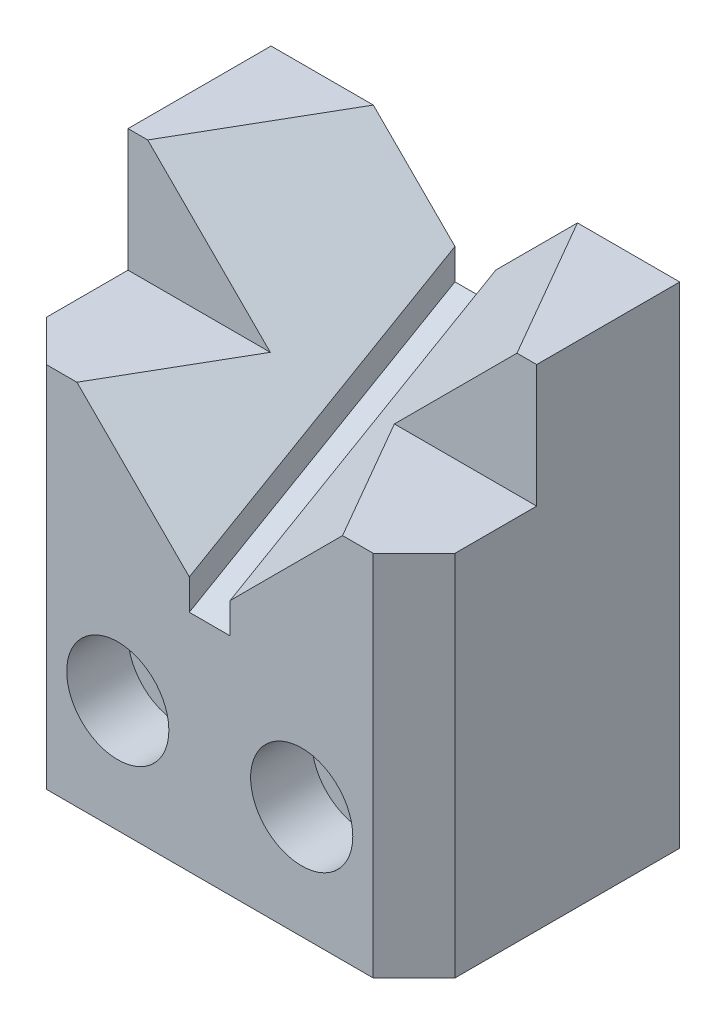
ISO-10303-21;
HEADER;
FILE_DESCRIPTION(('STEP AP214'),'2;1');
FILE_NAME('part.step','',(''),(''),'','','');
FILE_SCHEMA(('AUTOMOTIVE_DESIGN { 1 0 10303 214 1 1 1 1 }'));
ENDSEC;
DATA;
#1=APPLICATION_CONTEXT('core data for automotive mechanical design processes');
#2=APPLICATION_PROTOCOL_DEFINITION('international standard','automotive_design',2000,#1);
#3=PRODUCT_CONTEXT('',#1,'mechanical');
#4=PRODUCT('Part','Part','',(#3));
#5=PRODUCT_RELATED_PRODUCT_CATEGORY('part','',(#4));
#6=PRODUCT_DEFINITION_FORMATION('','',#4);
#7=PRODUCT_DEFINITION_CONTEXT('part definition',#1,'design');
#8=PRODUCT_DEFINITION('design','',#6,#7);
#9=PRODUCT_DEFINITION_SHAPE('','',#8);
#10=(LENGTH_UNIT() NAMED_UNIT(*) SI_UNIT(.MILLI.,.METRE.));
#11=(NAMED_UNIT(*) PLANE_ANGLE_UNIT() SI_UNIT($,.RADIAN.));
#12=(NAMED_UNIT(*) SI_UNIT($,.STERADIAN.) SOLID_ANGLE_UNIT());
#13=UNCERTAINTY_MEASURE_WITH_UNIT(LENGTH_MEASURE(1.E-05),#10,'distance_accuracy_value','');
#14=(GEOMETRIC_REPRESENTATION_CONTEXT(3) GLOBAL_UNCERTAINTY_ASSIGNED_CONTEXT((#13)) GLOBAL_UNIT_ASSIGNED_CONTEXT((#10,
#11,#12)) REPRESENTATION_CONTEXT('',''));
#15=CARTESIAN_POINT('',(0.,0.,0.));
#16=DIRECTION('',(0.,0.,1.));
#17=DIRECTION('',(1.,0.,0.));
#18=AXIS2_PLACEMENT_3D('',#15,#16,#17);
#19=CARTESIAN_POINT('',(31.75,0.,20.6375));
#20=DIRECTION('',(0.,0.,-1.));
#21=DIRECTION('',(-1.,0.,0.));
#22=AXIS2_PLACEMENT_3D('',#19,#20,#21);
#23=PLANE('',#22);
#24=CARTESIAN_POINT('',(14.2875,17.4625,20.6375));
#25=DIRECTION('',(0.,0.,1.));
#26=DIRECTION('',(1.,0.,0.));
#27=AXIS2_PLACEMENT_3D('',#24,#25,#26);
#28=CIRCLE('',#27,7.9375);
#29=CARTESIAN_POINT('',(22.225,17.4625,20.6375));
#30=VERTEX_POINT('',#29);
#31=EDGE_CURVE('E210',#30,#30,#28,.T.);
#32=ORIENTED_EDGE('',*,*,#31,.F.);
#33=EDGE_LOOP('',(#32));
#34=FACE_BOUND('',#33,.T.);
#35=CARTESIAN_POINT('',(-14.2875,17.4625,20.6375));
#36=DIRECTION('',(0.,0.,1.));
#37=DIRECTION('',(1.,0.,0.));
#38=AXIS2_PLACEMENT_3D('',#35,#36,#37);
#39=CIRCLE('',#38,7.9375);
#40=CARTESIAN_POINT('',(-6.35,17.4625,20.6375));
#41=VERTEX_POINT('',#40);
#42=EDGE_CURVE('E211',#41,#41,#39,.F.);
#43=ORIENTED_EDGE('',*,*,#42,.T.);
#44=EDGE_LOOP('',(#43));
#45=FACE_BOUND('',#44,.T.);
#46=DIRECTION('',(-1.,0.,0.));
#47=VECTOR('',#46,1.);
#48=CARTESIAN_POINT('',(31.75,57.15,20.6375));
#49=LINE('',#48,#47);
#50=CARTESIAN_POINT('',(-20.6375000000001,57.15,20.6375));
#51=VERTEX_POINT('',#50);
#52=CARTESIAN_POINT('',(-25.4,57.15,20.6375));
#53=VERTEX_POINT('',#52);
#54=EDGE_CURVE('E231',#51,#53,#49,.T.);
#55=ORIENTED_EDGE('',*,*,#54,.T.);
#56=DIRECTION('',(0.,-1.,0.));
#57=VECTOR('',#56,1.);
#58=CARTESIAN_POINT('',(-25.4,0.,20.6375));
#59=LINE('',#58,#57);
#60=CARTESIAN_POINT('',(-25.4,0.,20.6375));
#61=VERTEX_POINT('',#60);
#62=EDGE_CURVE('E281',#53,#61,#59,.T.);
#63=ORIENTED_EDGE('',*,*,#62,.T.);
#64=DIRECTION('',(-1.,0.,0.));
#65=VECTOR('',#64,1.);
#66=CARTESIAN_POINT('',(31.75,0.,20.6375));
#67=LINE('',#66,#65);
#68=CARTESIAN_POINT('',(25.4,0.,20.6375));
#69=VERTEX_POINT('',#68);
#70=EDGE_CURVE('E259',#69,#61,#67,.T.);
#71=ORIENTED_EDGE('',*,*,#70,.F.);
#72=DIRECTION('',(0.,1.,0.));
#73=VECTOR('',#72,1.);
#74=CARTESIAN_POINT('',(25.4,0.,20.6375));
#75=LINE('',#74,#73);
#76=CARTESIAN_POINT('',(25.4,57.15,20.6375));
#77=VERTEX_POINT('',#76);
#78=EDGE_CURVE('E279',#69,#77,#75,.T.);
#79=ORIENTED_EDGE('',*,*,#78,.T.);
#80=CARTESIAN_POINT('',(20.6375000000001,57.15,20.6375));
#81=VERTEX_POINT('',#80);
#82=EDGE_CURVE('E171',#77,#81,#49,.T.);
#83=ORIENTED_EDGE('',*,*,#82,.T.);
#84=DIRECTION('',(-0.707106781186549,-0.707106781186546,0.));
#85=VECTOR('',#84,1.);
#86=CARTESIAN_POINT('',(39.6875000000001,76.2,20.6375));
#87=LINE('',#86,#85);
#88=CARTESIAN_POINT('',(3.175,39.6875,20.6375));
#89=VERTEX_POINT('',#88);
#90=EDGE_CURVE('E152',#81,#89,#87,.T.);
#91=ORIENTED_EDGE('',*,*,#90,.T.);
#92=DIRECTION('',(0.,-1.,0.));
#93=VECTOR('',#92,1.);
#94=CARTESIAN_POINT('',(3.175,39.6875,20.6375));
#95=LINE('',#94,#93);
#96=CARTESIAN_POINT('',(3.175,34.925,20.6375));
#97=VERTEX_POINT('',#96);
#98=EDGE_CURVE('E162',#89,#97,#95,.T.);
#99=ORIENTED_EDGE('',*,*,#98,.T.);
#100=DIRECTION('',(1.,0.,0.));
#101=VECTOR('',#100,1.);
#102=CARTESIAN_POINT('',(-3.175,34.925,20.6375));
#103=LINE('',#102,#101);
#104=CARTESIAN_POINT('',(-3.175,34.925,20.6375));
#105=VERTEX_POINT('',#104);
#106=EDGE_CURVE('E168',#105,#97,#103,.T.);
#107=ORIENTED_EDGE('',*,*,#106,.F.);
#108=DIRECTION('',(0.,-1.,0.));
#109=VECTOR('',#108,1.);
#110=CARTESIAN_POINT('',(-3.175,39.6875,20.6375));
#111=LINE('',#110,#109);
#112=CARTESIAN_POINT('',(-3.175,39.6875,20.6375));
#113=VERTEX_POINT('',#112);
#114=EDGE_CURVE('E175',#113,#105,#111,.T.);
#115=ORIENTED_EDGE('',*,*,#114,.F.);
#116=DIRECTION('',(0.707106781186549,-0.707106781186546,0.));
#117=VECTOR('',#116,1.);
#118=CARTESIAN_POINT('',(-39.6875000000001,76.2,20.6375));
#119=LINE('',#118,#117);
#120=EDGE_CURVE('E178',#51,#113,#119,.T.);
#121=ORIENTED_EDGE('',*,*,#120,.F.);
#122=EDGE_LOOP('',(#55,#63,#71,#79,#83,#91,#99,#107,#115,#121));
#123=FACE_BOUND('',#122,.T.);
#124=ADVANCED_FACE('F33',(#34,#45,#123),#23,.F.);
#125=CARTESIAN_POINT('',(31.75,76.2,-20.6375));
#126=DIRECTION('',(0.,0.,1.));
#127=DIRECTION('',(0.,-1.,0.));
#128=AXIS2_PLACEMENT_3D('',#125,#126,#127);
#129=PLANE('',#128);
#130=CARTESIAN_POINT('',(-14.2875,17.4625,-20.6375));
#131=DIRECTION('',(0.,0.,1.));
#132=DIRECTION('',(1.,0.,0.));
#133=AXIS2_PLACEMENT_3D('',#130,#131,#132);
#134=CIRCLE('',#133,4.7625);
#135=CARTESIAN_POINT('',(-9.525,17.4625,-20.6375));
#136=VERTEX_POINT('',#135);
#137=EDGE_CURVE('E203',#136,#136,#134,.F.);
#138=ORIENTED_EDGE('',*,*,#137,.F.);
#139=EDGE_LOOP('',(#138));
#140=FACE_BOUND('',#139,.T.);
#141=CARTESIAN_POINT('',(14.2875,17.4625,-20.6375));
#142=DIRECTION('',(0.,0.,1.));
#143=DIRECTION('',(1.,0.,0.));
#144=AXIS2_PLACEMENT_3D('',#141,#142,#143);
#145=CIRCLE('',#144,4.7625);
#146=CARTESIAN_POINT('',(19.05,17.4625,-20.6375));
#147=VERTEX_POINT('',#146);
#148=EDGE_CURVE('E199',#147,#147,#145,.T.);
#149=ORIENTED_EDGE('',*,*,#148,.T.);
#150=EDGE_LOOP('',(#149));
#151=FACE_BOUND('',#150,.T.);
#152=DIRECTION('',(-0.707106781186549,-0.707106781186546,0.));
#153=VECTOR('',#152,1.);
#154=CARTESIAN_POINT('',(23.8036838195992,84.1463161804008,-20.6375));
#155=LINE('',#154,#153);
#156=CARTESIAN_POINT('',(15.8573676391984,76.2,-20.6375));
#157=VERTEX_POINT('',#156);
#158=CARTESIAN_POINT('',(3.175,63.5176323608017,-20.6375));
#159=VERTEX_POINT('',#158);
#160=EDGE_CURVE('E155',#157,#159,#155,.T.);
#161=ORIENTED_EDGE('',*,*,#160,.F.);
#162=DIRECTION('',(-1.,0.,0.));
#163=VECTOR('',#162,1.);
#164=CARTESIAN_POINT('',(31.75,76.2,-20.6375));
#165=LINE('',#164,#163);
#166=CARTESIAN_POINT('',(31.75,76.2,-20.6375));
#167=VERTEX_POINT('',#166);
#168=EDGE_CURVE('E253',#167,#157,#165,.T.);
#169=ORIENTED_EDGE('',*,*,#168,.F.);
#170=DIRECTION('',(0.,1.,0.));
#171=VECTOR('',#170,1.);
#172=CARTESIAN_POINT('',(31.75,76.2,-20.6375));
#173=LINE('',#172,#171);
#174=CARTESIAN_POINT('',(31.75,0.,-20.6375));
#175=VERTEX_POINT('',#174);
#176=EDGE_CURVE('E222',#175,#167,#173,.T.);
#177=ORIENTED_EDGE('',*,*,#176,.F.);
#178=DIRECTION('',(-1.,0.,0.));
#179=VECTOR('',#178,1.);
#180=CARTESIAN_POINT('',(31.75,0.,-20.6375));
#181=LINE('',#180,#179);
#182=CARTESIAN_POINT('',(-31.75,0.,-20.6375));
#183=VERTEX_POINT('',#182);
#184=EDGE_CURVE('E256',#175,#183,#181,.T.);
#185=ORIENTED_EDGE('',*,*,#184,.T.);
#186=DIRECTION('',(0.,1.,0.));
#187=VECTOR('',#186,1.);
#188=CARTESIAN_POINT('',(-31.75,76.2,-20.6375));
#189=LINE('',#188,#187);
#190=CARTESIAN_POINT('',(-31.75,76.2,-20.6375));
#191=VERTEX_POINT('',#190);
#192=EDGE_CURVE('E233',#183,#191,#189,.T.);
#193=ORIENTED_EDGE('',*,*,#192,.T.);
#194=CARTESIAN_POINT('',(-15.8573676391984,76.2,-20.6375));
#195=VERTEX_POINT('',#194);
#196=EDGE_CURVE('E252',#195,#191,#165,.T.);
#197=ORIENTED_EDGE('',*,*,#196,.F.);
#198=DIRECTION('',(0.707106781186549,-0.707106781186546,0.));
#199=VECTOR('',#198,1.);
#200=CARTESIAN_POINT('',(7.94631618040089,52.3963161804008,-20.6375));
#201=LINE('',#200,#199);
#202=CARTESIAN_POINT('',(-3.175,63.5176323608017,-20.6375));
#203=VERTEX_POINT('',#202);
#204=EDGE_CURVE('E191',#195,#203,#201,.T.);
#205=ORIENTED_EDGE('',*,*,#204,.T.);
#206=DIRECTION('',(0.,-1.,0.));
#207=VECTOR('',#206,1.);
#208=CARTESIAN_POINT('',(-3.175,76.2,-20.6375));
#209=LINE('',#208,#207);
#210=CARTESIAN_POINT('',(-3.17499999999999,58.7551323608017,-20.6375));
#211=VERTEX_POINT('',#210);
#212=EDGE_CURVE('E271',#203,#211,#209,.T.);
#213=ORIENTED_EDGE('',*,*,#212,.T.);
#214=DIRECTION('',(1.,0.,0.));
#215=VECTOR('',#214,1.);
#216=CARTESIAN_POINT('',(31.75,58.7551323608017,-20.6375));
#217=LINE('',#216,#215);
#218=CARTESIAN_POINT('',(3.175,58.7551323608017,-20.6375));
#219=VERTEX_POINT('',#218);
#220=EDGE_CURVE('E274',#211,#219,#217,.T.);
#221=ORIENTED_EDGE('',*,*,#220,.T.);
#222=DIRECTION('',(0.,-1.,0.));
#223=VECTOR('',#222,1.);
#224=CARTESIAN_POINT('',(3.175,76.2,-20.6375));
#225=LINE('',#224,#223);
#226=EDGE_CURVE('E277',#159,#219,#225,.T.);
#227=ORIENTED_EDGE('',*,*,#226,.F.);
#228=EDGE_LOOP('',(#161,#169,#177,#185,#193,#197,#205,#213,#221,#227));
#229=FACE_BOUND('',#228,.T.);
#230=ADVANCED_FACE('F304',(#140,#151,#229),#129,.F.);
#231=CARTESIAN_POINT('',(31.75,76.2,-20.6375));
#232=DIRECTION('',(0.,-1.,0.));
#233=DIRECTION('',(0.,0.,-1.));
#234=AXIS2_PLACEMENT_3D('',#231,#232,#233);
#235=PLANE('',#234);
#236=DIRECTION('',(-0.499999999999999,0.,-0.866025403784439));
#237=VECTOR('',#236,1.);
#238=CARTESIAN_POINT('',(19.8305257293988,76.2,-13.7557883212696));
#239=LINE('',#238,#237);
#240=CARTESIAN_POINT('',(28.6889773719378,76.2,1.58750000000001));
#241=VERTEX_POINT('',#240);
#242=EDGE_CURVE('E196',#241,#157,#239,.T.);
#243=ORIENTED_EDGE('',*,*,#242,.F.);
#244=DIRECTION('',(-1.,0.,0.));
#245=VECTOR('',#244,1.);
#246=CARTESIAN_POINT('',(31.75,76.2,1.58750000000001));
#247=LINE('',#246,#245);
#248=CARTESIAN_POINT('',(31.75,76.2,1.58750000000001));
#249=VERTEX_POINT('',#248);
#250=EDGE_CURVE('E249',#249,#241,#247,.T.);
#251=ORIENTED_EDGE('',*,*,#250,.F.);
#252=DIRECTION('',(0.,0.,1.));
#253=VECTOR('',#252,1.);
#254=CARTESIAN_POINT('',(31.75,76.2,-20.6375));
#255=LINE('',#254,#253);
#256=EDGE_CURVE('E225',#167,#249,#255,.T.);
#257=ORIENTED_EDGE('',*,*,#256,.F.);
#258=ORIENTED_EDGE('',*,*,#168,.T.);
#259=EDGE_LOOP('',(#243,#251,#257,#258));
#260=FACE_BOUND('',#259,.T.);
#261=ADVANCED_FACE('F311',(#260),#235,.F.);
#262=CARTESIAN_POINT('',(31.75,76.2,1.58750000000001));
#263=DIRECTION('',(0.,0.,-1.));
#264=DIRECTION('',(0.,1.,0.));
#265=AXIS2_PLACEMENT_3D('',#262,#263,#264);
#266=PLANE('',#265);
#267=DIRECTION('',(0.707106781186549,0.707106781186546,0.));
#268=VECTOR('',#267,1.);
#269=CARTESIAN_POINT('',(30.2194886859689,77.7305113140311,1.58750000000001));
#270=LINE('',#269,#268);
#271=CARTESIAN_POINT('',(9.63897737193771,57.15,1.58750000000001));
#272=VERTEX_POINT('',#271);
#273=EDGE_CURVE('E194',#272,#241,#270,.T.);
#274=ORIENTED_EDGE('',*,*,#273,.F.);
#275=DIRECTION('',(-1.,0.,0.));
#276=VECTOR('',#275,1.);
#277=CARTESIAN_POINT('',(31.75,57.15,1.58750000000001));
#278=LINE('',#277,#276);
#279=CARTESIAN_POINT('',(31.75,57.15,1.58750000000001));
#280=VERTEX_POINT('',#279);
#281=EDGE_CURVE('E245',#280,#272,#278,.T.);
#282=ORIENTED_EDGE('',*,*,#281,.F.);
#283=DIRECTION('',(0.,-1.,0.));
#284=VECTOR('',#283,1.);
#285=CARTESIAN_POINT('',(31.75,76.2,1.58750000000001));
#286=LINE('',#285,#284);
#287=EDGE_CURVE('E227',#249,#280,#286,.T.);
#288=ORIENTED_EDGE('',*,*,#287,.F.);
#289=ORIENTED_EDGE('',*,*,#250,.T.);
#290=EDGE_LOOP('',(#274,#282,#288,#289));
#291=FACE_BOUND('',#290,.T.);
#292=ADVANCED_FACE('F314',(#291),#266,.F.);
#293=CARTESIAN_POINT('',(31.75,57.15,20.6375));
#294=DIRECTION('',(0.,-1.,0.));
#295=DIRECTION('',(0.,0.,-1.));
#296=AXIS2_PLACEMENT_3D('',#293,#294,#295);
#297=PLANE('',#296);
#298=ORIENTED_EDGE('',*,*,#82,.F.);
#299=DIRECTION('',(-0.707106781186548,0.,0.707106781186547));
#300=VECTOR('',#299,1.);
#301=CARTESIAN_POINT('',(31.75,57.15,14.2875));
#302=LINE('',#301,#300);
#303=CARTESIAN_POINT('',(31.75,57.15,14.2875));
#304=VERTEX_POINT('',#303);
#305=EDGE_CURVE('E11',#77,#304,#302,.F.);
#306=ORIENTED_EDGE('',*,*,#305,.T.);
#307=DIRECTION('',(0.,0.,1.));
#308=VECTOR('',#307,1.);
#309=CARTESIAN_POINT('',(31.75,57.15,20.6375));
#310=LINE('',#309,#308);
#311=EDGE_CURVE('E229',#280,#304,#310,.T.);
#312=ORIENTED_EDGE('',*,*,#311,.F.);
#313=ORIENTED_EDGE('',*,*,#281,.T.);
#314=DIRECTION('',(-0.499999999999999,0.,-0.866025403784439));
#315=VECTOR('',#314,1.);
#316=CARTESIAN_POINT('',(23.415625,57.15,25.4493536497773));
#317=LINE('',#316,#315);
#318=EDGE_CURVE('E269',#81,#272,#317,.T.);
#319=ORIENTED_EDGE('',*,*,#318,.F.);
#320=EDGE_LOOP('',(#298,#306,#312,#313,#319));
#321=FACE_BOUND('',#320,.T.);
#322=ADVANCED_FACE('F315',(#321),#297,.F.);
#323=CARTESIAN_POINT('',(31.75,0.,20.6375));
#324=DIRECTION('',(0.,1.,0.));
#325=DIRECTION('',(0.,0.,1.));
#326=AXIS2_PLACEMENT_3D('',#323,#324,#325);
#327=PLANE('',#326);
#328=ORIENTED_EDGE('',*,*,#70,.T.);
#329=DIRECTION('',(-0.707106781186547,0.,-0.707106781186548));
#330=VECTOR('',#329,1.);
#331=CARTESIAN_POINT('',(-25.4,0.,20.6375));
#332=LINE('',#331,#330);
#333=CARTESIAN_POINT('',(-31.75,0.,14.2875));
#334=VERTEX_POINT('',#333);
#335=EDGE_CURVE('E286',#61,#334,#332,.T.);
#336=ORIENTED_EDGE('',*,*,#335,.T.);
#337=DIRECTION('',(0.,0.,-1.));
#338=VECTOR('',#337,1.);
#339=CARTESIAN_POINT('',(-31.75,0.,20.6375));
#340=LINE('',#339,#338);
#341=EDGE_CURVE('E217',#334,#183,#340,.T.);
#342=ORIENTED_EDGE('',*,*,#341,.T.);
#343=ORIENTED_EDGE('',*,*,#184,.F.);
#344=DIRECTION('',(0.,0.,-1.));
#345=VECTOR('',#344,1.);
#346=CARTESIAN_POINT('',(31.75,0.,20.6375));
#347=LINE('',#346,#345);
#348=CARTESIAN_POINT('',(31.75,0.,14.2875));
#349=VERTEX_POINT('',#348);
#350=EDGE_CURVE('E220',#349,#175,#347,.T.);
#351=ORIENTED_EDGE('',*,*,#350,.F.);
#352=DIRECTION('',(0.707106781186548,0.,-0.707106781186547));
#353=VECTOR('',#352,1.);
#354=CARTESIAN_POINT('',(31.75,0.,14.2875));
#355=LINE('',#354,#353);
#356=EDGE_CURVE('E284',#349,#69,#355,.F.);
#357=ORIENTED_EDGE('',*,*,#356,.T.);
#358=EDGE_LOOP('',(#328,#336,#342,#343,#351,#357));
#359=FACE_BOUND('',#358,.T.);
#360=ADVANCED_FACE('F298',(#359),#327,.F.);
#361=CARTESIAN_POINT('',(-28.6889773719378,76.2,1.58750000000001));
#362=VERTEX_POINT('',#361);
#363=CARTESIAN_POINT('',(-31.75,76.2,1.58750000000001));
#364=VERTEX_POINT('',#363);
#365=EDGE_CURVE('E248',#362,#364,#247,.T.);
#366=ORIENTED_EDGE('',*,*,#365,.F.);
#367=DIRECTION('',(0.499999999999999,0.,-0.866025403784439));
#368=VECTOR('',#367,1.);
#369=CARTESIAN_POINT('',(-3.95552572939883,76.2,-41.2520948914255));
#370=LINE('',#369,#368);
#371=EDGE_CURVE('E188',#362,#195,#370,.T.);
#372=ORIENTED_EDGE('',*,*,#371,.T.);
#373=ORIENTED_EDGE('',*,*,#196,.T.);
#374=DIRECTION('',(0.,0.,1.));
#375=VECTOR('',#374,1.);
#376=CARTESIAN_POINT('',(-31.75,76.2,-20.6375));
#377=LINE('',#376,#375);
#378=EDGE_CURVE('E236',#191,#364,#377,.T.);
#379=ORIENTED_EDGE('',*,*,#378,.T.);
#380=EDGE_LOOP('',(#366,#372,#373,#379));
#381=FACE_BOUND('',#380,.T.);
#382=ADVANCED_FACE('F323',(#381),#235,.F.);
#383=CARTESIAN_POINT('',(-9.63897737193771,57.15,1.58750000000001));
#384=VERTEX_POINT('',#383);
#385=CARTESIAN_POINT('',(-31.75,57.15,1.58750000000001));
#386=VERTEX_POINT('',#385);
#387=EDGE_CURVE('E244',#384,#386,#278,.T.);
#388=ORIENTED_EDGE('',*,*,#387,.F.);
#389=DIRECTION('',(-0.707106781186549,0.707106781186546,0.));
#390=VECTOR('',#389,1.);
#391=CARTESIAN_POINT('',(1.53051131403122,45.9805113140311,1.58750000000001));
#392=LINE('',#391,#390);
#393=EDGE_CURVE('E158',#384,#362,#392,.T.);
#394=ORIENTED_EDGE('',*,*,#393,.T.);
#395=ORIENTED_EDGE('',*,*,#365,.T.);
#396=DIRECTION('',(0.,-1.,0.));
#397=VECTOR('',#396,1.);
#398=CARTESIAN_POINT('',(-31.75,76.2,1.58750000000001));
#399=LINE('',#398,#397);
#400=EDGE_CURVE('E239',#364,#386,#399,.T.);
#401=ORIENTED_EDGE('',*,*,#400,.T.);
#402=EDGE_LOOP('',(#388,#394,#395,#401));
#403=FACE_BOUND('',#402,.T.);
#404=ADVANCED_FACE('F327',(#403),#266,.F.);
#405=DIRECTION('',(0.,0.,1.));
#406=VECTOR('',#405,1.);
#407=CARTESIAN_POINT('',(-31.75,57.15,20.6375));
#408=LINE('',#407,#406);
#409=CARTESIAN_POINT('',(-31.75,57.15,14.2875));
#410=VERTEX_POINT('',#409);
#411=EDGE_CURVE('E223',#386,#410,#408,.T.);
#412=ORIENTED_EDGE('',*,*,#411,.T.);
#413=DIRECTION('',(0.707106781186547,0.,0.707106781186548));
#414=VECTOR('',#413,1.);
#415=CARTESIAN_POINT('',(-25.4,57.15,20.6375));
#416=LINE('',#415,#414);
#417=EDGE_CURVE('E289',#410,#53,#416,.T.);
#418=ORIENTED_EDGE('',*,*,#417,.T.);
#419=ORIENTED_EDGE('',*,*,#54,.F.);
#420=DIRECTION('',(0.499999999999999,0.,-0.866025403784439));
#421=VECTOR('',#420,1.);
#422=CARTESIAN_POINT('',(-7.54062500000008,57.15,-2.04695292037865));
#423=LINE('',#422,#421);
#424=EDGE_CURVE('E262',#51,#384,#423,.T.);
#425=ORIENTED_EDGE('',*,*,#424,.T.);
#426=ORIENTED_EDGE('',*,*,#387,.T.);
#427=EDGE_LOOP('',(#412,#418,#419,#425,#426));
#428=FACE_BOUND('',#427,.T.);
#429=ADVANCED_FACE('F318',(#428),#297,.F.);
#430=CARTESIAN_POINT('',(31.75,0.,0.));
#431=DIRECTION('',(-1.,0.,0.));
#432=DIRECTION('',(0.,0.,1.));
#433=AXIS2_PLACEMENT_3D('',#430,#431,#432);
#434=PLANE('',#433);
#435=ORIENTED_EDGE('',*,*,#311,.T.);
#436=DIRECTION('',(0.,-1.,0.));
#437=VECTOR('',#436,1.);
#438=CARTESIAN_POINT('',(31.75,0.,14.2875));
#439=LINE('',#438,#437);
#440=EDGE_CURVE('E41',#304,#349,#439,.T.);
#441=ORIENTED_EDGE('',*,*,#440,.T.);
#442=ORIENTED_EDGE('',*,*,#350,.T.);
#443=ORIENTED_EDGE('',*,*,#176,.T.);
#444=ORIENTED_EDGE('',*,*,#256,.T.);
#445=ORIENTED_EDGE('',*,*,#287,.T.);
#446=EDGE_LOOP('',(#435,#441,#442,#443,#444,#445));
#447=FACE_BOUND('',#446,.T.);
#448=ADVANCED_FACE('F294',(#447),#434,.F.);
#449=CARTESIAN_POINT('',(-31.75,0.,0.));
#450=DIRECTION('',(-1.,0.,0.));
#451=DIRECTION('',(0.,0.,1.));
#452=AXIS2_PLACEMENT_3D('',#449,#450,#451);
#453=PLANE('',#452);
#454=ORIENTED_EDGE('',*,*,#341,.F.);
#455=DIRECTION('',(0.,1.,0.));
#456=VECTOR('',#455,1.);
#457=CARTESIAN_POINT('',(-31.75,57.15,14.2875));
#458=LINE('',#457,#456);
#459=EDGE_CURVE('E54',#334,#410,#458,.T.);
#460=ORIENTED_EDGE('',*,*,#459,.T.);
#461=ORIENTED_EDGE('',*,*,#411,.F.);
#462=ORIENTED_EDGE('',*,*,#400,.F.);
#463=ORIENTED_EDGE('',*,*,#378,.F.);
#464=ORIENTED_EDGE('',*,*,#192,.F.);
#465=EDGE_LOOP('',(#454,#460,#461,#462,#463,#464));
#466=FACE_BOUND('',#465,.T.);
#467=ADVANCED_FACE('F362',(#466),#453,.T.);
#468=CARTESIAN_POINT('',(14.2875,17.4625,11.1125));
#469=DIRECTION('',(0.,0.,1.));
#470=DIRECTION('',(1.,0.,0.));
#471=AXIS2_PLACEMENT_3D('',#468,#469,#470);
#472=CYLINDRICAL_SURFACE('',#471,7.9375);
#473=CARTESIAN_POINT('',(14.2875,17.4625,11.1125));
#474=DIRECTION('',(0.,0.,1.));
#475=DIRECTION('',(1.,0.,0.));
#476=AXIS2_PLACEMENT_3D('',#473,#474,#475);
#477=CIRCLE('',#476,7.9375);
#478=CARTESIAN_POINT('',(22.225,17.4625,11.1125));
#479=VERTEX_POINT('',#478);
#480=EDGE_CURVE('E214',#479,#479,#477,.T.);
#481=ORIENTED_EDGE('',*,*,#480,.F.);
#482=EDGE_LOOP('',(#481));
#483=FACE_BOUND('',#482,.T.);
#484=ORIENTED_EDGE('',*,*,#31,.T.);
#485=EDGE_LOOP('',(#484));
#486=FACE_BOUND('',#485,.T.);
#487=ADVANCED_FACE('F364',(#483,#486),#472,.F.);
#488=CARTESIAN_POINT('',(0.,0.,11.1125));
#489=DIRECTION('',(0.,0.,1.));
#490=DIRECTION('',(1.,0.,0.));
#491=AXIS2_PLACEMENT_3D('',#488,#489,#490);
#492=PLANE('',#491);
#493=CARTESIAN_POINT('',(14.2875,17.4625,11.1125));
#494=DIRECTION('',(0.,0.,1.));
#495=DIRECTION('',(1.,0.,0.));
#496=AXIS2_PLACEMENT_3D('',#493,#494,#495);
#497=CIRCLE('',#496,4.7625);
#498=CARTESIAN_POINT('',(19.05,17.4625,11.1125));
#499=VERTEX_POINT('',#498);
#500=EDGE_CURVE('E202',#499,#499,#497,.T.);
#501=ORIENTED_EDGE('',*,*,#500,.F.);
#502=EDGE_LOOP('',(#501));
#503=FACE_BOUND('',#502,.T.);
#504=ORIENTED_EDGE('',*,*,#480,.T.);
#505=EDGE_LOOP('',(#504));
#506=FACE_BOUND('',#505,.T.);
#507=ADVANCED_FACE('F369',(#503,#506),#492,.T.);
#508=CARTESIAN_POINT('',(-14.2875,17.4625,11.1125));
#509=DIRECTION('',(0.,0.,1.));
#510=DIRECTION('',(1.,0.,0.));
#511=AXIS2_PLACEMENT_3D('',#508,#509,#510);
#512=CYLINDRICAL_SURFACE('',#511,7.9375);
#513=CARTESIAN_POINT('',(-14.2875,17.4625,11.1125));
#514=DIRECTION('',(0.,0.,1.));
#515=DIRECTION('',(1.,0.,0.));
#516=AXIS2_PLACEMENT_3D('',#513,#514,#515);
#517=CIRCLE('',#516,7.9375);
#518=CARTESIAN_POINT('',(-6.35,17.4625,11.1125));
#519=VERTEX_POINT('',#518);
#520=EDGE_CURVE('E207',#519,#519,#517,.F.);
#521=ORIENTED_EDGE('',*,*,#520,.T.);
#522=EDGE_LOOP('',(#521));
#523=FACE_BOUND('',#522,.T.);
#524=ORIENTED_EDGE('',*,*,#42,.F.);
#525=EDGE_LOOP('',(#524));
#526=FACE_BOUND('',#525,.T.);
#527=ADVANCED_FACE('F376',(#523,#526),#512,.F.);
#528=CARTESIAN_POINT('',(0.,0.,11.1125));
#529=DIRECTION('',(0.,0.,1.));
#530=DIRECTION('',(1.,0.,0.));
#531=AXIS2_PLACEMENT_3D('',#528,#529,#530);
#532=PLANE('',#531);
#533=CARTESIAN_POINT('',(-14.2875,17.4625,11.1125));
#534=DIRECTION('',(0.,0.,1.));
#535=DIRECTION('',(1.,0.,0.));
#536=AXIS2_PLACEMENT_3D('',#533,#534,#535);
#537=CIRCLE('',#536,4.7625);
#538=CARTESIAN_POINT('',(-9.525,17.4625,11.1125));
#539=VERTEX_POINT('',#538);
#540=EDGE_CURVE('E206',#539,#539,#537,.F.);
#541=ORIENTED_EDGE('',*,*,#540,.T.);
#542=EDGE_LOOP('',(#541));
#543=FACE_BOUND('',#542,.T.);
#544=ORIENTED_EDGE('',*,*,#520,.F.);
#545=EDGE_LOOP('',(#544));
#546=FACE_BOUND('',#545,.T.);
#547=ADVANCED_FACE('F380',(#543,#546),#532,.T.);
#548=CARTESIAN_POINT('',(-14.2875,17.4625,-20.6375));
#549=DIRECTION('',(0.,0.,1.));
#550=DIRECTION('',(1.,0.,0.));
#551=AXIS2_PLACEMENT_3D('',#548,#549,#550);
#552=CYLINDRICAL_SURFACE('',#551,4.7625);
#553=ORIENTED_EDGE('',*,*,#540,.F.);
#554=EDGE_LOOP('',(#553));
#555=FACE_BOUND('',#554,.T.);
#556=ORIENTED_EDGE('',*,*,#137,.T.);
#557=EDGE_LOOP('',(#556));
#558=FACE_BOUND('',#557,.T.);
#559=ADVANCED_FACE('F384',(#555,#558),#552,.F.);
#560=CARTESIAN_POINT('',(14.2875,17.4625,-20.6375));
#561=DIRECTION('',(0.,0.,1.));
#562=DIRECTION('',(1.,0.,0.));
#563=AXIS2_PLACEMENT_3D('',#560,#561,#562);
#564=CYLINDRICAL_SURFACE('',#563,4.7625);
#565=ORIENTED_EDGE('',*,*,#500,.T.);
#566=EDGE_LOOP('',(#565));
#567=FACE_BOUND('',#566,.T.);
#568=ORIENTED_EDGE('',*,*,#148,.F.);
#569=EDGE_LOOP('',(#568));
#570=FACE_BOUND('',#569,.T.);
#571=ADVANCED_FACE('F388',(#567,#570),#564,.F.);
#572=CARTESIAN_POINT('',(3.175,67.8788492706012,-28.1913492706014));
#573=DIRECTION('',(-1.,0.,0.));
#574=DIRECTION('',(0.,-1.,0.));
#575=AXIS2_PLACEMENT_3D('',#572,#573,#574);
#576=PLANE('',#575);
#577=ORIENTED_EDGE('',*,*,#226,.T.);
#578=DIRECTION('',(0.,-0.499999999999998,0.86602540378444));
#579=VECTOR('',#578,1.);
#580=CARTESIAN_POINT('',(3.175,63.1163492706012,-28.1913492706014));
#581=LINE('',#580,#579);
#582=EDGE_CURVE('E159',#219,#97,#581,.T.);
#583=ORIENTED_EDGE('',*,*,#582,.T.);
#584=ORIENTED_EDGE('',*,*,#98,.F.);
#585=DIRECTION('',(0.,-0.499999999999998,0.86602540378444));
#586=VECTOR('',#585,1.);
#587=CARTESIAN_POINT('',(3.175,67.8788492706012,-28.1913492706014));
#588=LINE('',#587,#586);
#589=EDGE_CURVE('E148',#159,#89,#588,.T.);
#590=ORIENTED_EDGE('',*,*,#589,.F.);
#591=EDGE_LOOP('',(#577,#583,#584,#590));
#592=FACE_BOUND('',#591,.T.);
#593=ADVANCED_FACE('F163',(#592),#576,.T.);
#594=CARTESIAN_POINT('',(-3.175,63.1163492706012,-28.1913492706014));
#595=DIRECTION('',(0.,-0.86602540378444,-0.499999999999998));
#596=DIRECTION('',(0.,0.499999999999998,-0.86602540378444));
#597=AXIS2_PLACEMENT_3D('',#594,#595,#596);
#598=PLANE('',#597);
#599=DIRECTION('',(0.,-0.499999999999998,0.86602540378444));
#600=VECTOR('',#599,1.);
#601=CARTESIAN_POINT('',(-3.175,63.1163492706012,-28.1913492706014));
#602=LINE('',#601,#600);
#603=EDGE_CURVE('E183',#211,#105,#602,.T.);
#604=ORIENTED_EDGE('',*,*,#603,.T.);
#605=ORIENTED_EDGE('',*,*,#106,.T.);
#606=ORIENTED_EDGE('',*,*,#582,.F.);
#607=ORIENTED_EDGE('',*,*,#220,.F.);
#608=EDGE_LOOP('',(#604,#605,#606,#607));
#609=FACE_BOUND('',#608,.T.);
#610=ADVANCED_FACE('F398',(#609),#598,.F.);
#611=CARTESIAN_POINT('',(-3.175,67.8788492706012,-28.1913492706014));
#612=DIRECTION('',(-1.,0.,0.));
#613=DIRECTION('',(0.,-1.,0.));
#614=AXIS2_PLACEMENT_3D('',#611,#612,#613);
#615=PLANE('',#614);
#616=DIRECTION('',(0.,-0.499999999999998,0.86602540378444));
#617=VECTOR('',#616,1.);
#618=CARTESIAN_POINT('',(-3.175,67.8788492706012,-28.1913492706014));
#619=LINE('',#618,#617);
#620=EDGE_CURVE('E181',#203,#113,#619,.T.);
#621=ORIENTED_EDGE('',*,*,#620,.T.);
#622=ORIENTED_EDGE('',*,*,#114,.T.);
#623=ORIENTED_EDGE('',*,*,#603,.F.);
#624=ORIENTED_EDGE('',*,*,#212,.F.);
#625=EDGE_LOOP('',(#621,#622,#623,#624));
#626=FACE_BOUND('',#625,.T.);
#627=ADVANCED_FACE('F395',(#626),#615,.F.);
#628=CARTESIAN_POINT('',(39.6875000000001,104.391349270601,-28.1913492706014));
#629=DIRECTION('',(-0.654653670707976,0.654653670707979,0.377964473009226));
#630=DIRECTION('',(-0.707106781186549,-0.707106781186546,0.));
#631=AXIS2_PLACEMENT_3D('',#628,#629,#630);
#632=PLANE('',#631);
#633=ORIENTED_EDGE('',*,*,#160,.T.);
#634=ORIENTED_EDGE('',*,*,#589,.T.);
#635=ORIENTED_EDGE('',*,*,#90,.F.);
#636=ORIENTED_EDGE('',*,*,#318,.T.);
#637=ORIENTED_EDGE('',*,*,#273,.T.);
#638=ORIENTED_EDGE('',*,*,#242,.T.);
#639=EDGE_LOOP('',(#633,#634,#635,#636,#637,#638));
#640=FACE_BOUND('',#639,.T.);
#641=ADVANCED_FACE('F150',(#640),#632,.T.);
#642=CARTESIAN_POINT('',(-39.6875000000001,104.391349270601,-28.1913492706014));
#643=DIRECTION('',(-0.654653670707976,-0.654653670707979,-0.377964473009226));
#644=DIRECTION('',(0.707106781186549,-0.707106781186546,0.));
#645=AXIS2_PLACEMENT_3D('',#642,#643,#644);
#646=PLANE('',#645);
#647=ORIENTED_EDGE('',*,*,#371,.F.);
#648=ORIENTED_EDGE('',*,*,#393,.F.);
#649=ORIENTED_EDGE('',*,*,#424,.F.);
#650=ORIENTED_EDGE('',*,*,#120,.T.);
#651=ORIENTED_EDGE('',*,*,#620,.F.);
#652=ORIENTED_EDGE('',*,*,#204,.F.);
#653=EDGE_LOOP('',(#647,#648,#649,#650,#651,#652));
#654=FACE_BOUND('',#653,.T.);
#655=ADVANCED_FACE('F343',(#654),#646,.F.);
#656=CARTESIAN_POINT('',(-25.4,0.,20.6375));
#657=DIRECTION('',(-0.707106781186548,0.,0.707106781186547));
#658=DIRECTION('',(0.,1.,0.));
#659=AXIS2_PLACEMENT_3D('',#656,#657,#658);
#660=PLANE('',#659);
#661=ORIENTED_EDGE('',*,*,#417,.F.);
#662=ORIENTED_EDGE('',*,*,#459,.F.);
#663=ORIENTED_EDGE('',*,*,#335,.F.);
#664=ORIENTED_EDGE('',*,*,#62,.F.);
#665=EDGE_LOOP('',(#661,#662,#663,#664));
#666=FACE_BOUND('',#665,.T.);
#667=ADVANCED_FACE('F341',(#666),#660,.T.);
#668=CARTESIAN_POINT('',(31.75,0.,14.2875));
#669=DIRECTION('',(-0.707106781186547,0.,-0.707106781186548));
#670=DIRECTION('',(0.,-1.,0.));
#671=AXIS2_PLACEMENT_3D('',#668,#669,#670);
#672=PLANE('',#671);
#673=ORIENTED_EDGE('',*,*,#305,.F.);
#674=ORIENTED_EDGE('',*,*,#78,.F.);
#675=ORIENTED_EDGE('',*,*,#356,.F.);
#676=ORIENTED_EDGE('',*,*,#440,.F.);
#677=EDGE_LOOP('',(#673,#674,#675,#676));
#678=FACE_BOUND('',#677,.T.);
#679=ADVANCED_FACE('F35',(#678),#672,.F.);
#680=CLOSED_SHELL('',(#124,#230,#261,#292,#322,#360,#382,#404,#429,#448,#467,#487,#507,#527,
#547,#559,#571,#593,#610,#627,#641,#655,#667,#679));
#681=MANIFOLD_SOLID_BREP('B2',#680);
#682=ADVANCED_BREP_SHAPE_REPRESENTATION('',(#18,#681),#14);
#683=SHAPE_DEFINITION_REPRESENTATION(#9,#682);
ENDSEC;
END-ISO-10303-21;
